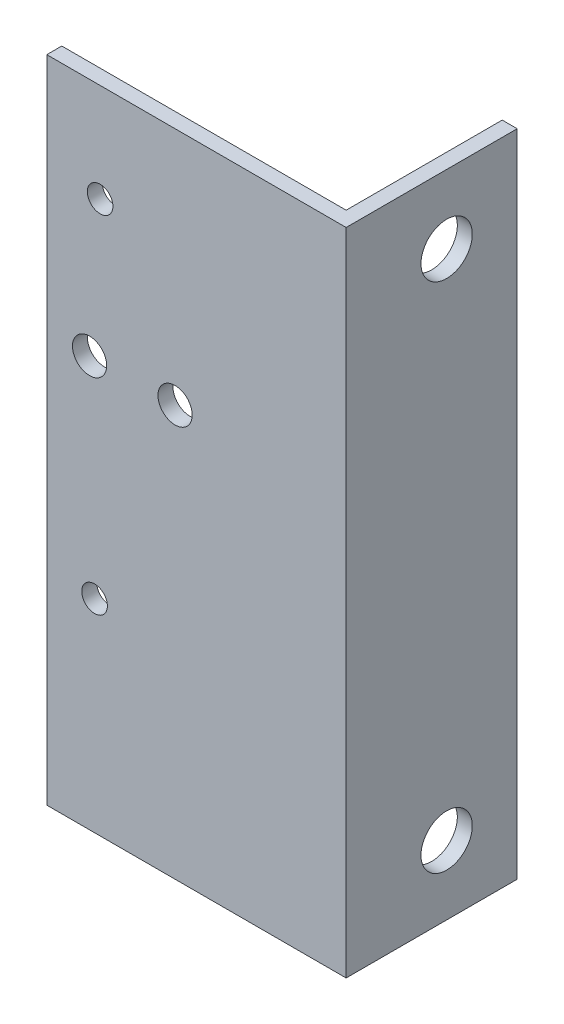
ISO-10303-21;
HEADER;
FILE_DESCRIPTION(('STEP AP214'),'2;1');
FILE_NAME('part.step','',(''),(''),'','','');
FILE_SCHEMA(('AUTOMOTIVE_DESIGN { 1 0 10303 214 1 1 1 1 }'));
ENDSEC;
DATA;
#1=APPLICATION_CONTEXT('core data for automotive mechanical design processes');
#2=APPLICATION_PROTOCOL_DEFINITION('international standard','automotive_design',2000,#1);
#3=PRODUCT_CONTEXT('',#1,'mechanical');
#4=PRODUCT('Part','Part','',(#3));
#5=PRODUCT_RELATED_PRODUCT_CATEGORY('part','',(#4));
#6=PRODUCT_DEFINITION_FORMATION('','',#4);
#7=PRODUCT_DEFINITION_CONTEXT('part definition',#1,'design');
#8=PRODUCT_DEFINITION('design','',#6,#7);
#9=PRODUCT_DEFINITION_SHAPE('','',#8);
#10=(LENGTH_UNIT() NAMED_UNIT(*) SI_UNIT(.MILLI.,.METRE.));
#11=(NAMED_UNIT(*) PLANE_ANGLE_UNIT() SI_UNIT($,.RADIAN.));
#12=(NAMED_UNIT(*) SI_UNIT($,.STERADIAN.) SOLID_ANGLE_UNIT());
#13=UNCERTAINTY_MEASURE_WITH_UNIT(LENGTH_MEASURE(1.E-05),#10,'distance_accuracy_value','');
#14=(GEOMETRIC_REPRESENTATION_CONTEXT(3) GLOBAL_UNCERTAINTY_ASSIGNED_CONTEXT((#13)) GLOBAL_UNIT_ASSIGNED_CONTEXT((#10,
#11,#12)) REPRESENTATION_CONTEXT('',''));
#15=CARTESIAN_POINT('',(0.,0.,0.));
#16=DIRECTION('',(0.,0.,1.));
#17=DIRECTION('',(1.,0.,0.));
#18=AXIS2_PLACEMENT_3D('',#15,#16,#17);
#19=CARTESIAN_POINT('',(0.,76.,1.75));
#20=DIRECTION('',(-1.,0.,0.));
#21=DIRECTION('',(0.,0.,1.));
#22=AXIS2_PLACEMENT_3D('',#19,#20,#21);
#23=PLANE('',#22);
#24=CARTESIAN_POINT('',(0.,67.9549999999984,-9.99999999999945));
#25=DIRECTION('',(-1.,0.,0.));
#26=DIRECTION('',(0.,0.,1.));
#27=AXIS2_PLACEMENT_3D('',#24,#25,#26);
#28=CIRCLE('',#27,3.);
#29=CARTESIAN_POINT('',(0.,67.9549999999984,-6.99999999999945));
#30=VERTEX_POINT('',#29);
#31=EDGE_CURVE('E165',#30,#30,#28,.F.);
#32=ORIENTED_EDGE('',*,*,#31,.F.);
#33=EDGE_LOOP('',(#32));
#34=FACE_BOUND('',#33,.T.);
#35=CARTESIAN_POINT('',(0.,8.05,-9.99999999999945));
#36=DIRECTION('',(-1.,0.,0.));
#37=DIRECTION('',(0.,0.,1.));
#38=AXIS2_PLACEMENT_3D('',#35,#36,#37);
#39=CIRCLE('',#38,3.);
#40=CARTESIAN_POINT('',(0.,8.05,-6.99999999999945));
#41=VERTEX_POINT('',#40);
#42=EDGE_CURVE('E123',#41,#41,#39,.F.);
#43=ORIENTED_EDGE('',*,*,#42,.F.);
#44=EDGE_LOOP('',(#43));
#45=FACE_BOUND('',#44,.T.);
#46=DIRECTION('',(0.,0.,-1.));
#47=VECTOR('',#46,1.);
#48=CARTESIAN_POINT('',(0.,0.,1.75));
#49=LINE('',#48,#47);
#50=CARTESIAN_POINT('',(0.,0.,1.75));
#51=VERTEX_POINT('',#50);
#52=CARTESIAN_POINT('',(0.,0.,-18.25));
#53=VERTEX_POINT('',#52);
#54=EDGE_CURVE('E119',#51,#53,#49,.T.);
#55=ORIENTED_EDGE('',*,*,#54,.T.);
#56=DIRECTION('',(0.,-1.,0.));
#57=VECTOR('',#56,1.);
#58=CARTESIAN_POINT('',(0.,76.,-18.25));
#59=LINE('',#58,#57);
#60=CARTESIAN_POINT('',(0.,76.,-18.25));
#61=VERTEX_POINT('',#60);
#62=EDGE_CURVE('E11',#61,#53,#59,.T.);
#63=ORIENTED_EDGE('',*,*,#62,.F.);
#64=DIRECTION('',(0.,0.,-1.));
#65=VECTOR('',#64,1.);
#66=CARTESIAN_POINT('',(0.,76.,1.75));
#67=LINE('',#66,#65);
#68=CARTESIAN_POINT('',(0.,76.,1.75));
#69=VERTEX_POINT('',#68);
#70=EDGE_CURVE('E130',#69,#61,#67,.T.);
#71=ORIENTED_EDGE('',*,*,#70,.F.);
#72=DIRECTION('',(0.,-1.,0.));
#73=VECTOR('',#72,1.);
#74=CARTESIAN_POINT('',(0.,76.,1.75));
#75=LINE('',#74,#73);
#76=EDGE_CURVE('E115',#69,#51,#75,.T.);
#77=ORIENTED_EDGE('',*,*,#76,.T.);
#78=EDGE_LOOP('',(#55,#63,#71,#77));
#79=FACE_BOUND('',#78,.T.);
#80=ADVANCED_FACE('F35',(#34,#45,#79),#23,.F.);
#81=CARTESIAN_POINT('',(-1.75,76.,-18.25));
#82=DIRECTION('',(0.,0.,1.));
#83=DIRECTION('',(1.,0.,0.));
#84=AXIS2_PLACEMENT_3D('',#81,#82,#83);
#85=PLANE('',#84);
#86=DIRECTION('',(-1.,0.,0.));
#87=VECTOR('',#86,1.);
#88=CARTESIAN_POINT('',(-1.75,0.,-18.25));
#89=LINE('',#88,#87);
#90=CARTESIAN_POINT('',(-1.75,0.,-18.25));
#91=VERTEX_POINT('',#90);
#92=EDGE_CURVE('E122',#53,#91,#89,.T.);
#93=ORIENTED_EDGE('',*,*,#92,.T.);
#94=DIRECTION('',(0.,-1.,0.));
#95=VECTOR('',#94,1.);
#96=CARTESIAN_POINT('',(-1.75,76.,-18.25));
#97=LINE('',#96,#95);
#98=CARTESIAN_POINT('',(-1.75,76.,-18.25));
#99=VERTEX_POINT('',#98);
#100=EDGE_CURVE('E43',#99,#91,#97,.T.);
#101=ORIENTED_EDGE('',*,*,#100,.F.);
#102=DIRECTION('',(-1.,0.,0.));
#103=VECTOR('',#102,1.);
#104=CARTESIAN_POINT('',(-1.75,76.,-18.25));
#105=LINE('',#104,#103);
#106=EDGE_CURVE('E88',#61,#99,#105,.T.);
#107=ORIENTED_EDGE('',*,*,#106,.F.);
#108=ORIENTED_EDGE('',*,*,#62,.T.);
#109=EDGE_LOOP('',(#93,#101,#107,#108));
#110=FACE_BOUND('',#109,.T.);
#111=ADVANCED_FACE('F157',(#110),#85,.F.);
#112=CARTESIAN_POINT('',(-1.75,76.,-18.25));
#113=DIRECTION('',(1.,0.,0.));
#114=DIRECTION('',(0.,0.,-1.));
#115=AXIS2_PLACEMENT_3D('',#112,#113,#114);
#116=PLANE('',#115);
#117=CARTESIAN_POINT('',(-1.75,67.9549999999984,-9.99999999999945));
#118=DIRECTION('',(-1.,0.,0.));
#119=DIRECTION('',(0.,0.,1.));
#120=AXIS2_PLACEMENT_3D('',#117,#118,#119);
#121=CIRCLE('',#120,3.);
#122=CARTESIAN_POINT('',(-1.75,67.9549999999984,-6.99999999999945));
#123=VERTEX_POINT('',#122);
#124=EDGE_CURVE('E177',#123,#123,#121,.T.);
#125=ORIENTED_EDGE('',*,*,#124,.F.);
#126=EDGE_LOOP('',(#125));
#127=FACE_BOUND('',#126,.T.);
#128=CARTESIAN_POINT('',(-1.75,8.05,-9.99999999999945));
#129=DIRECTION('',(-1.,0.,0.));
#130=DIRECTION('',(0.,0.,1.));
#131=AXIS2_PLACEMENT_3D('',#128,#129,#130);
#132=CIRCLE('',#131,3.);
#133=CARTESIAN_POINT('',(-1.75,8.05,-6.99999999999945));
#134=VERTEX_POINT('',#133);
#135=EDGE_CURVE('E169',#134,#134,#132,.T.);
#136=ORIENTED_EDGE('',*,*,#135,.F.);
#137=EDGE_LOOP('',(#136));
#138=FACE_BOUND('',#137,.T.);
#139=DIRECTION('',(0.,0.,1.));
#140=VECTOR('',#139,1.);
#141=CARTESIAN_POINT('',(-1.75,0.,-18.25));
#142=LINE('',#141,#140);
#143=CARTESIAN_POINT('',(-1.75,0.,0.));
#144=VERTEX_POINT('',#143);
#145=EDGE_CURVE('E125',#91,#144,#142,.T.);
#146=ORIENTED_EDGE('',*,*,#145,.T.);
#147=DIRECTION('',(0.,-1.,0.));
#148=VECTOR('',#147,1.);
#149=CARTESIAN_POINT('',(-1.75,76.,0.));
#150=LINE('',#149,#148);
#151=CARTESIAN_POINT('',(-1.75,76.,0.));
#152=VERTEX_POINT('',#151);
#153=EDGE_CURVE('E110',#152,#144,#150,.T.);
#154=ORIENTED_EDGE('',*,*,#153,.F.);
#155=DIRECTION('',(0.,0.,1.));
#156=VECTOR('',#155,1.);
#157=CARTESIAN_POINT('',(-1.75,76.,-18.25));
#158=LINE('',#157,#156);
#159=EDGE_CURVE('E101',#99,#152,#158,.T.);
#160=ORIENTED_EDGE('',*,*,#159,.F.);
#161=ORIENTED_EDGE('',*,*,#100,.T.);
#162=EDGE_LOOP('',(#146,#154,#160,#161));
#163=FACE_BOUND('',#162,.T.);
#164=ADVANCED_FACE('F136',(#127,#138,#163),#116,.F.);
#165=CARTESIAN_POINT('',(-35.,76.,0.));
#166=DIRECTION('',(0.,0.,1.));
#167=DIRECTION('',(1.,0.,0.));
#168=AXIS2_PLACEMENT_3D('',#165,#166,#167);
#169=PLANE('',#168);
#170=CARTESIAN_POINT('',(-20.,48.,0.));
#171=DIRECTION('',(0.,0.,1.));
#172=DIRECTION('',(1.,0.,0.));
#173=AXIS2_PLACEMENT_3D('',#170,#171,#172);
#174=CIRCLE('',#173,2.00000000000001);
#175=CARTESIAN_POINT('',(-18.,48.,0.));
#176=VERTEX_POINT('',#175);
#177=EDGE_CURVE('E198',#176,#176,#174,.F.);
#178=ORIENTED_EDGE('',*,*,#177,.F.);
#179=EDGE_LOOP('',(#178));
#180=FACE_BOUND('',#179,.T.);
#181=CARTESIAN_POINT('',(-30.,48.,0.));
#182=DIRECTION('',(0.,0.,1.));
#183=DIRECTION('',(1.,0.,0.));
#184=AXIS2_PLACEMENT_3D('',#181,#182,#183);
#185=CIRCLE('',#184,2.00000000000001);
#186=CARTESIAN_POINT('',(-28.,48.,0.));
#187=VERTEX_POINT('',#186);
#188=EDGE_CURVE('E192',#187,#187,#185,.F.);
#189=ORIENTED_EDGE('',*,*,#188,.F.);
#190=EDGE_LOOP('',(#189));
#191=FACE_BOUND('',#190,.T.);
#192=CARTESIAN_POINT('',(-29.41701924,23.7,0.));
#193=DIRECTION('',(0.,0.,1.));
#194=DIRECTION('',(1.,0.,0.));
#195=AXIS2_PLACEMENT_3D('',#192,#193,#194);
#196=CIRCLE('',#195,1.5);
#197=CARTESIAN_POINT('',(-27.91701924,23.7,0.));
#198=VERTEX_POINT('',#197);
#199=EDGE_CURVE('E186',#198,#198,#196,.F.);
#200=ORIENTED_EDGE('',*,*,#199,.F.);
#201=EDGE_LOOP('',(#200));
#202=FACE_BOUND('',#201,.T.);
#203=CARTESIAN_POINT('',(-28.76701924,64.5,0.));
#204=DIRECTION('',(0.,0.,1.));
#205=DIRECTION('',(1.,0.,0.));
#206=AXIS2_PLACEMENT_3D('',#203,#204,#205);
#207=CIRCLE('',#206,1.5);
#208=CARTESIAN_POINT('',(-27.26701924,64.5,0.));
#209=VERTEX_POINT('',#208);
#210=EDGE_CURVE('E180',#209,#209,#207,.F.);
#211=ORIENTED_EDGE('',*,*,#210,.F.);
#212=EDGE_LOOP('',(#211));
#213=FACE_BOUND('',#212,.T.);
#214=DIRECTION('',(-1.,0.,0.));
#215=VECTOR('',#214,1.);
#216=CARTESIAN_POINT('',(-35.,0.,0.));
#217=LINE('',#216,#215);
#218=CARTESIAN_POINT('',(-35.,0.,0.));
#219=VERTEX_POINT('',#218);
#220=EDGE_CURVE('E109',#144,#219,#217,.T.);
#221=ORIENTED_EDGE('',*,*,#220,.T.);
#222=DIRECTION('',(0.,-1.,0.));
#223=VECTOR('',#222,1.);
#224=CARTESIAN_POINT('',(-35.,76.,0.));
#225=LINE('',#224,#223);
#226=CARTESIAN_POINT('',(-35.,76.,0.));
#227=VERTEX_POINT('',#226);
#228=EDGE_CURVE('E106',#227,#219,#225,.T.);
#229=ORIENTED_EDGE('',*,*,#228,.F.);
#230=DIRECTION('',(-1.,0.,0.));
#231=VECTOR('',#230,1.);
#232=CARTESIAN_POINT('',(-35.,76.,0.));
#233=LINE('',#232,#231);
#234=EDGE_CURVE('E95',#152,#227,#233,.T.);
#235=ORIENTED_EDGE('',*,*,#234,.F.);
#236=ORIENTED_EDGE('',*,*,#153,.T.);
#237=EDGE_LOOP('',(#221,#229,#235,#236));
#238=FACE_BOUND('',#237,.T.);
#239=ADVANCED_FACE('F107',(#180,#191,#202,#213,#238),#169,.F.);
#240=CARTESIAN_POINT('',(-35.,76.,0.));
#241=DIRECTION('',(1.,0.,0.));
#242=DIRECTION('',(0.,0.,-1.));
#243=AXIS2_PLACEMENT_3D('',#240,#241,#242);
#244=PLANE('',#243);
#245=DIRECTION('',(0.,0.,1.));
#246=VECTOR('',#245,1.);
#247=CARTESIAN_POINT('',(-35.,0.,0.));
#248=LINE('',#247,#246);
#249=CARTESIAN_POINT('',(-35.,0.,1.75));
#250=VERTEX_POINT('',#249);
#251=EDGE_CURVE('E74',#219,#250,#248,.T.);
#252=ORIENTED_EDGE('',*,*,#251,.T.);
#253=DIRECTION('',(0.,-1.,0.));
#254=VECTOR('',#253,1.);
#255=CARTESIAN_POINT('',(-35.,76.,1.75));
#256=LINE('',#255,#254);
#257=CARTESIAN_POINT('',(-35.,76.,1.75));
#258=VERTEX_POINT('',#257);
#259=EDGE_CURVE('E111',#258,#250,#256,.T.);
#260=ORIENTED_EDGE('',*,*,#259,.F.);
#261=DIRECTION('',(0.,0.,1.));
#262=VECTOR('',#261,1.);
#263=CARTESIAN_POINT('',(-35.,76.,0.));
#264=LINE('',#263,#262);
#265=EDGE_CURVE('E99',#227,#258,#264,.T.);
#266=ORIENTED_EDGE('',*,*,#265,.F.);
#267=ORIENTED_EDGE('',*,*,#228,.T.);
#268=EDGE_LOOP('',(#252,#260,#266,#267));
#269=FACE_BOUND('',#268,.T.);
#270=ADVANCED_FACE('F113',(#269),#244,.F.);
#271=CARTESIAN_POINT('',(0.,76.,1.75));
#272=DIRECTION('',(0.,0.,-1.));
#273=DIRECTION('',(-1.,0.,0.));
#274=AXIS2_PLACEMENT_3D('',#271,#272,#273);
#275=PLANE('',#274);
#276=CARTESIAN_POINT('',(-20.,48.,1.75));
#277=DIRECTION('',(0.,0.,1.));
#278=DIRECTION('',(1.,0.,0.));
#279=AXIS2_PLACEMENT_3D('',#276,#277,#278);
#280=CIRCLE('',#279,2.00000000000001);
#281=CARTESIAN_POINT('',(-18.,48.,1.75));
#282=VERTEX_POINT('',#281);
#283=EDGE_CURVE('E201',#282,#282,#280,.T.);
#284=ORIENTED_EDGE('',*,*,#283,.F.);
#285=EDGE_LOOP('',(#284));
#286=FACE_BOUND('',#285,.T.);
#287=CARTESIAN_POINT('',(-30.,48.,1.75));
#288=DIRECTION('',(0.,0.,1.));
#289=DIRECTION('',(1.,0.,0.));
#290=AXIS2_PLACEMENT_3D('',#287,#288,#289);
#291=CIRCLE('',#290,2.00000000000001);
#292=CARTESIAN_POINT('',(-28.,48.,1.75));
#293=VERTEX_POINT('',#292);
#294=EDGE_CURVE('E195',#293,#293,#291,.T.);
#295=ORIENTED_EDGE('',*,*,#294,.F.);
#296=EDGE_LOOP('',(#295));
#297=FACE_BOUND('',#296,.T.);
#298=CARTESIAN_POINT('',(-29.41701924,23.7,1.75));
#299=DIRECTION('',(0.,0.,1.));
#300=DIRECTION('',(1.,0.,0.));
#301=AXIS2_PLACEMENT_3D('',#298,#299,#300);
#302=CIRCLE('',#301,1.5);
#303=CARTESIAN_POINT('',(-27.91701924,23.7,1.75));
#304=VERTEX_POINT('',#303);
#305=EDGE_CURVE('E189',#304,#304,#302,.T.);
#306=ORIENTED_EDGE('',*,*,#305,.F.);
#307=EDGE_LOOP('',(#306));
#308=FACE_BOUND('',#307,.T.);
#309=CARTESIAN_POINT('',(-28.76701924,64.5,1.75));
#310=DIRECTION('',(0.,0.,1.));
#311=DIRECTION('',(1.,0.,0.));
#312=AXIS2_PLACEMENT_3D('',#309,#310,#311);
#313=CIRCLE('',#312,1.5);
#314=CARTESIAN_POINT('',(-27.26701924,64.5,1.75));
#315=VERTEX_POINT('',#314);
#316=EDGE_CURVE('E183',#315,#315,#313,.T.);
#317=ORIENTED_EDGE('',*,*,#316,.F.);
#318=EDGE_LOOP('',(#317));
#319=FACE_BOUND('',#318,.T.);
#320=DIRECTION('',(1.,0.,0.));
#321=VECTOR('',#320,1.);
#322=CARTESIAN_POINT('',(0.,0.,1.75));
#323=LINE('',#322,#321);
#324=EDGE_CURVE('E80',#250,#51,#323,.T.);
#325=ORIENTED_EDGE('',*,*,#324,.T.);
#326=ORIENTED_EDGE('',*,*,#76,.F.);
#327=DIRECTION('',(1.,0.,0.));
#328=VECTOR('',#327,1.);
#329=CARTESIAN_POINT('',(0.,76.,1.75));
#330=LINE('',#329,#328);
#331=EDGE_CURVE('E51',#258,#69,#330,.T.);
#332=ORIENTED_EDGE('',*,*,#331,.F.);
#333=ORIENTED_EDGE('',*,*,#259,.T.);
#334=EDGE_LOOP('',(#325,#326,#332,#333));
#335=FACE_BOUND('',#334,.T.);
#336=ADVANCED_FACE('F143',(#286,#297,#308,#319,#335),#275,.F.);
#337=CARTESIAN_POINT('',(0.,76.,0.));
#338=DIRECTION('',(0.,-1.,0.));
#339=DIRECTION('',(0.,0.,-1.));
#340=AXIS2_PLACEMENT_3D('',#337,#338,#339);
#341=PLANE('',#340);
#342=ORIENTED_EDGE('',*,*,#70,.T.);
#343=ORIENTED_EDGE('',*,*,#106,.T.);
#344=ORIENTED_EDGE('',*,*,#159,.T.);
#345=ORIENTED_EDGE('',*,*,#234,.T.);
#346=ORIENTED_EDGE('',*,*,#265,.T.);
#347=ORIENTED_EDGE('',*,*,#331,.T.);
#348=EDGE_LOOP('',(#342,#343,#344,#345,#346,#347));
#349=FACE_BOUND('',#348,.T.);
#350=ADVANCED_FACE('F97',(#349),#341,.F.);
#351=CARTESIAN_POINT('',(0.,0.,0.));
#352=DIRECTION('',(0.,-1.,0.));
#353=DIRECTION('',(0.,0.,-1.));
#354=AXIS2_PLACEMENT_3D('',#351,#352,#353);
#355=PLANE('',#354);
#356=ORIENTED_EDGE('',*,*,#54,.F.);
#357=ORIENTED_EDGE('',*,*,#324,.F.);
#358=ORIENTED_EDGE('',*,*,#251,.F.);
#359=ORIENTED_EDGE('',*,*,#220,.F.);
#360=ORIENTED_EDGE('',*,*,#145,.F.);
#361=ORIENTED_EDGE('',*,*,#92,.F.);
#362=EDGE_LOOP('',(#356,#357,#358,#359,#360,#361));
#363=FACE_BOUND('',#362,.T.);
#364=ADVANCED_FACE('F139',(#363),#355,.T.);
#365=CARTESIAN_POINT('',(0.000999999999999916,8.05,-9.99999999999945));
#366=DIRECTION('',(-1.,0.,0.));
#367=DIRECTION('',(0.,0.,1.));
#368=AXIS2_PLACEMENT_3D('',#365,#366,#367);
#369=CYLINDRICAL_SURFACE('',#368,3.);
#370=ORIENTED_EDGE('',*,*,#135,.T.);
#371=EDGE_LOOP('',(#370));
#372=FACE_BOUND('',#371,.T.);
#373=ORIENTED_EDGE('',*,*,#42,.T.);
#374=EDGE_LOOP('',(#373));
#375=FACE_BOUND('',#374,.T.);
#376=ADVANCED_FACE('F232',(#372,#375),#369,.F.);
#377=CARTESIAN_POINT('',(0.000999999999999916,67.9549999999984,-9.99999999999945));
#378=DIRECTION('',(-1.,0.,0.));
#379=DIRECTION('',(0.,0.,1.));
#380=AXIS2_PLACEMENT_3D('',#377,#378,#379);
#381=CYLINDRICAL_SURFACE('',#380,3.);
#382=ORIENTED_EDGE('',*,*,#124,.T.);
#383=EDGE_LOOP('',(#382));
#384=FACE_BOUND('',#383,.T.);
#385=ORIENTED_EDGE('',*,*,#31,.T.);
#386=EDGE_LOOP('',(#385));
#387=FACE_BOUND('',#386,.T.);
#388=ADVANCED_FACE('F223',(#384,#387),#381,.F.);
#389=CARTESIAN_POINT('',(-28.76701924,64.5,-18.251));
#390=DIRECTION('',(0.,0.,1.));
#391=DIRECTION('',(1.,0.,0.));
#392=AXIS2_PLACEMENT_3D('',#389,#390,#391);
#393=CYLINDRICAL_SURFACE('',#392,1.5);
#394=ORIENTED_EDGE('',*,*,#316,.T.);
#395=EDGE_LOOP('',(#394));
#396=FACE_BOUND('',#395,.T.);
#397=ORIENTED_EDGE('',*,*,#210,.T.);
#398=EDGE_LOOP('',(#397));
#399=FACE_BOUND('',#398,.T.);
#400=ADVANCED_FACE('F220',(#396,#399),#393,.F.);
#401=CARTESIAN_POINT('',(-29.41701924,23.7,-18.251));
#402=DIRECTION('',(0.,0.,1.));
#403=DIRECTION('',(1.,0.,0.));
#404=AXIS2_PLACEMENT_3D('',#401,#402,#403);
#405=CYLINDRICAL_SURFACE('',#404,1.5);
#406=ORIENTED_EDGE('',*,*,#305,.T.);
#407=EDGE_LOOP('',(#406));
#408=FACE_BOUND('',#407,.T.);
#409=ORIENTED_EDGE('',*,*,#199,.T.);
#410=EDGE_LOOP('',(#409));
#411=FACE_BOUND('',#410,.T.);
#412=ADVANCED_FACE('F222',(#408,#411),#405,.F.);
#413=CARTESIAN_POINT('',(-30.,48.,-18.251));
#414=DIRECTION('',(0.,0.,1.));
#415=DIRECTION('',(1.,0.,0.));
#416=AXIS2_PLACEMENT_3D('',#413,#414,#415);
#417=CYLINDRICAL_SURFACE('',#416,2.00000000000001);
#418=ORIENTED_EDGE('',*,*,#294,.T.);
#419=EDGE_LOOP('',(#418));
#420=FACE_BOUND('',#419,.T.);
#421=ORIENTED_EDGE('',*,*,#188,.T.);
#422=EDGE_LOOP('',(#421));
#423=FACE_BOUND('',#422,.T.);
#424=ADVANCED_FACE('F207',(#420,#423),#417,.F.);
#425=CARTESIAN_POINT('',(-20.,48.,-18.251));
#426=DIRECTION('',(0.,0.,1.));
#427=DIRECTION('',(1.,0.,0.));
#428=AXIS2_PLACEMENT_3D('',#425,#426,#427);
#429=CYLINDRICAL_SURFACE('',#428,2.00000000000001);
#430=ORIENTED_EDGE('',*,*,#283,.T.);
#431=EDGE_LOOP('',(#430));
#432=FACE_BOUND('',#431,.T.);
#433=ORIENTED_EDGE('',*,*,#177,.T.);
#434=EDGE_LOOP('',(#433));
#435=FACE_BOUND('',#434,.T.);
#436=ADVANCED_FACE('F204',(#432,#435),#429,.F.);
#437=CLOSED_SHELL('',(#80,#111,#164,#239,#270,#336,#350,#364,#376,#388,#400,#412,#424,#436));
#438=MANIFOLD_SOLID_BREP('B2',#437);
#439=ADVANCED_BREP_SHAPE_REPRESENTATION('',(#18,#438),#14);
#440=SHAPE_DEFINITION_REPRESENTATION(#9,#439);
ENDSEC;
END-ISO-10303-21;
